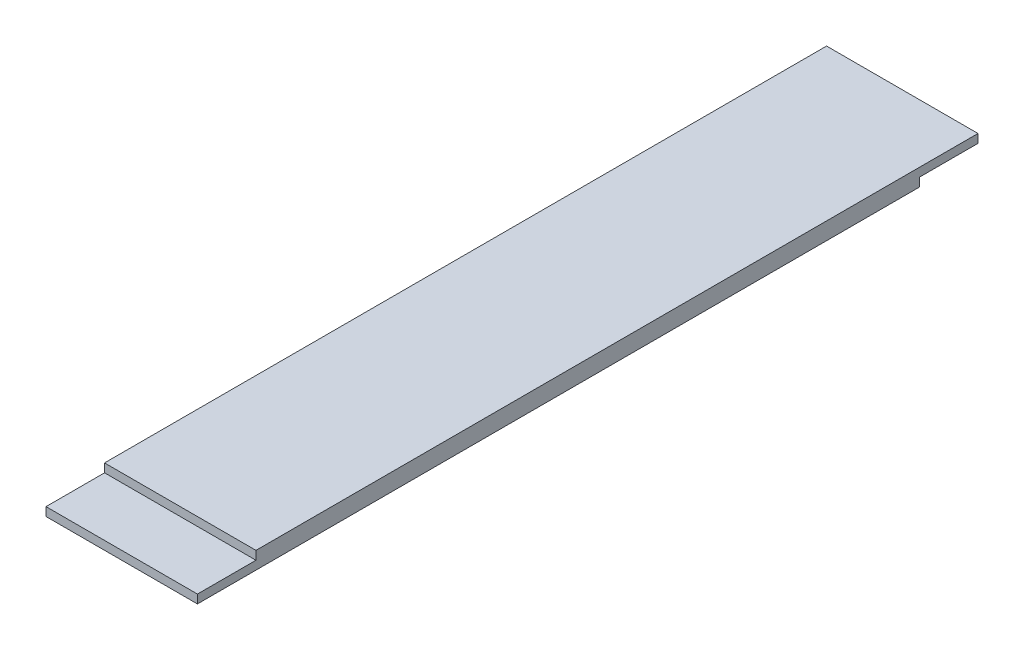
ISO-10303-21;
HEADER;
FILE_DESCRIPTION(('STEP AP214'),'2;1');
FILE_NAME('part.step','',(''),(''),'','','');
FILE_SCHEMA(('AUTOMOTIVE_DESIGN { 1 0 10303 214 1 1 1 1 }'));
ENDSEC;
DATA;
#1=APPLICATION_CONTEXT('core data for automotive mechanical design processes');
#2=APPLICATION_PROTOCOL_DEFINITION('international standard','automotive_design',2000,#1);
#3=PRODUCT_CONTEXT('',#1,'mechanical');
#4=PRODUCT('Part','Part','',(#3));
#5=PRODUCT_RELATED_PRODUCT_CATEGORY('part','',(#4));
#6=PRODUCT_DEFINITION_FORMATION('','',#4);
#7=PRODUCT_DEFINITION_CONTEXT('part definition',#1,'design');
#8=PRODUCT_DEFINITION('design','',#6,#7);
#9=PRODUCT_DEFINITION_SHAPE('','',#8);
#10=(LENGTH_UNIT() NAMED_UNIT(*) SI_UNIT(.MILLI.,.METRE.));
#11=(NAMED_UNIT(*) PLANE_ANGLE_UNIT() SI_UNIT($,.RADIAN.));
#12=(NAMED_UNIT(*) SI_UNIT($,.STERADIAN.) SOLID_ANGLE_UNIT());
#13=UNCERTAINTY_MEASURE_WITH_UNIT(LENGTH_MEASURE(1.E-05),#10,'distance_accuracy_value','');
#14=(GEOMETRIC_REPRESENTATION_CONTEXT(3) GLOBAL_UNCERTAINTY_ASSIGNED_CONTEXT((#13)) GLOBAL_UNIT_ASSIGNED_CONTEXT((#10,
#11,#12)) REPRESENTATION_CONTEXT('',''));
#15=CARTESIAN_POINT('',(0.,0.,0.));
#16=DIRECTION('',(0.,0.,1.));
#17=DIRECTION('',(1.,0.,0.));
#18=AXIS2_PLACEMENT_3D('',#15,#16,#17);
#19=CARTESIAN_POINT('',(19.4,4.4,100.));
#20=DIRECTION('',(-1.,0.,0.));
#21=DIRECTION('',(0.,0.,1.));
#22=AXIS2_PLACEMENT_3D('',#19,#20,#21);
#23=PLANE('',#22);
#24=DIRECTION('',(0.,0.,-1.));
#25=VECTOR('',#24,1.);
#26=CARTESIAN_POINT('',(19.4,0.,100.));
#27=LINE('',#26,#25);
#28=CARTESIAN_POINT('',(19.4,0.,100.));
#29=VERTEX_POINT('',#28);
#30=CARTESIAN_POINT('',(19.4,0.,-85.));
#31=VERTEX_POINT('',#30);
#32=EDGE_CURVE('E134',#29,#31,#27,.T.);
#33=ORIENTED_EDGE('',*,*,#32,.T.);
#34=DIRECTION('',(0.,-1.,0.));
#35=VECTOR('',#34,1.);
#36=CARTESIAN_POINT('',(19.4,2.2,-85.));
#37=LINE('',#36,#35);
#38=CARTESIAN_POINT('',(19.4,2.2,-85.));
#39=VERTEX_POINT('',#38);
#40=EDGE_CURVE('E47',#39,#31,#37,.T.);
#41=ORIENTED_EDGE('',*,*,#40,.F.);
#42=DIRECTION('',(0.,0.,1.));
#43=VECTOR('',#42,1.);
#44=CARTESIAN_POINT('',(19.4,2.2,-100.));
#45=LINE('',#44,#43);
#46=CARTESIAN_POINT('',(19.4,2.2,-100.));
#47=VERTEX_POINT('',#46);
#48=EDGE_CURVE('E116',#47,#39,#45,.T.);
#49=ORIENTED_EDGE('',*,*,#48,.F.);
#50=DIRECTION('',(0.,-1.,0.));
#51=VECTOR('',#50,1.);
#52=CARTESIAN_POINT('',(19.4,4.4,-100.));
#53=LINE('',#52,#51);
#54=CARTESIAN_POINT('',(19.4,4.4,-100.));
#55=VERTEX_POINT('',#54);
#56=EDGE_CURVE('E11',#55,#47,#53,.T.);
#57=ORIENTED_EDGE('',*,*,#56,.F.);
#58=DIRECTION('',(0.,0.,-1.));
#59=VECTOR('',#58,1.);
#60=CARTESIAN_POINT('',(19.4,4.4,100.));
#61=LINE('',#60,#59);
#62=CARTESIAN_POINT('',(19.4,4.4,85.));
#63=VERTEX_POINT('',#62);
#64=EDGE_CURVE('E131',#63,#55,#61,.T.);
#65=ORIENTED_EDGE('',*,*,#64,.F.);
#66=DIRECTION('',(0.,1.,0.));
#67=VECTOR('',#66,1.);
#68=CARTESIAN_POINT('',(19.4,2.2,85.));
#69=LINE('',#68,#67);
#70=CARTESIAN_POINT('',(19.4,2.2,85.));
#71=VERTEX_POINT('',#70);
#72=EDGE_CURVE('E55',#71,#63,#69,.T.);
#73=ORIENTED_EDGE('',*,*,#72,.F.);
#74=DIRECTION('',(0.,0.,-1.));
#75=VECTOR('',#74,1.);
#76=CARTESIAN_POINT('',(19.4,2.2,100.));
#77=LINE('',#76,#75);
#78=CARTESIAN_POINT('',(19.4,2.2,100.));
#79=VERTEX_POINT('',#78);
#80=EDGE_CURVE('E151',#79,#71,#77,.T.);
#81=ORIENTED_EDGE('',*,*,#80,.F.);
#82=DIRECTION('',(0.,-1.,0.));
#83=VECTOR('',#82,1.);
#84=CARTESIAN_POINT('',(19.4,4.4,100.));
#85=LINE('',#84,#83);
#86=EDGE_CURVE('E124',#79,#29,#85,.T.);
#87=ORIENTED_EDGE('',*,*,#86,.T.);
#88=EDGE_LOOP('',(#33,#41,#49,#57,#65,#73,#81,#87));
#89=FACE_BOUND('',#88,.T.);
#90=ADVANCED_FACE('F33',(#89),#23,.F.);
#91=CARTESIAN_POINT('',(-19.4,4.4,-100.));
#92=DIRECTION('',(0.,0.,1.));
#93=DIRECTION('',(1.,0.,0.));
#94=AXIS2_PLACEMENT_3D('',#91,#92,#93);
#95=PLANE('',#94);
#96=ORIENTED_EDGE('',*,*,#56,.T.);
#97=DIRECTION('',(1.,0.,0.));
#98=VECTOR('',#97,1.);
#99=CARTESIAN_POINT('',(-19.4,2.2,-100.));
#100=LINE('',#99,#98);
#101=CARTESIAN_POINT('',(-19.4,2.2,-100.));
#102=VERTEX_POINT('',#101);
#103=EDGE_CURVE('E102',#102,#47,#100,.T.);
#104=ORIENTED_EDGE('',*,*,#103,.F.);
#105=DIRECTION('',(0.,-1.,0.));
#106=VECTOR('',#105,1.);
#107=CARTESIAN_POINT('',(-19.4,4.4,-100.));
#108=LINE('',#107,#106);
#109=CARTESIAN_POINT('',(-19.4,4.4,-100.));
#110=VERTEX_POINT('',#109);
#111=EDGE_CURVE('E40',#110,#102,#108,.T.);
#112=ORIENTED_EDGE('',*,*,#111,.F.);
#113=DIRECTION('',(-1.,0.,0.));
#114=VECTOR('',#113,1.);
#115=CARTESIAN_POINT('',(-19.4,4.4,-100.));
#116=LINE('',#115,#114);
#117=EDGE_CURVE('E139',#55,#110,#116,.T.);
#118=ORIENTED_EDGE('',*,*,#117,.F.);
#119=EDGE_LOOP('',(#96,#104,#112,#118));
#120=FACE_BOUND('',#119,.T.);
#121=ADVANCED_FACE('F112',(#120),#95,.F.);
#122=CARTESIAN_POINT('',(-19.4,4.4,100.));
#123=DIRECTION('',(1.,0.,0.));
#124=DIRECTION('',(0.,0.,-1.));
#125=AXIS2_PLACEMENT_3D('',#122,#123,#124);
#126=PLANE('',#125);
#127=DIRECTION('',(0.,0.,-1.));
#128=VECTOR('',#127,1.);
#129=CARTESIAN_POINT('',(-19.4,2.2,-100.));
#130=LINE('',#129,#128);
#131=CARTESIAN_POINT('',(-19.4,2.2,-85.));
#132=VERTEX_POINT('',#131);
#133=EDGE_CURVE('E99',#132,#102,#130,.T.);
#134=ORIENTED_EDGE('',*,*,#133,.F.);
#135=DIRECTION('',(0.,-1.,0.));
#136=VECTOR('',#135,1.);
#137=CARTESIAN_POINT('',(-19.4,2.2,-85.));
#138=LINE('',#137,#136);
#139=CARTESIAN_POINT('',(-19.4,0.,-85.));
#140=VERTEX_POINT('',#139);
#141=EDGE_CURVE('E148',#132,#140,#138,.T.);
#142=ORIENTED_EDGE('',*,*,#141,.T.);
#143=DIRECTION('',(0.,0.,1.));
#144=VECTOR('',#143,1.);
#145=CARTESIAN_POINT('',(-19.4,0.,100.));
#146=LINE('',#145,#144);
#147=CARTESIAN_POINT('',(-19.4,0.,100.));
#148=VERTEX_POINT('',#147);
#149=EDGE_CURVE('E132',#140,#148,#146,.T.);
#150=ORIENTED_EDGE('',*,*,#149,.T.);
#151=DIRECTION('',(0.,-1.,0.));
#152=VECTOR('',#151,1.);
#153=CARTESIAN_POINT('',(-19.4,4.4,100.));
#154=LINE('',#153,#152);
#155=CARTESIAN_POINT('',(-19.4,2.2,100.));
#156=VERTEX_POINT('',#155);
#157=EDGE_CURVE('E122',#156,#148,#154,.T.);
#158=ORIENTED_EDGE('',*,*,#157,.F.);
#159=DIRECTION('',(0.,0.,1.));
#160=VECTOR('',#159,1.);
#161=CARTESIAN_POINT('',(-19.4,2.2,100.));
#162=LINE('',#161,#160);
#163=CARTESIAN_POINT('',(-19.4,2.2,85.));
#164=VERTEX_POINT('',#163);
#165=EDGE_CURVE('E147',#164,#156,#162,.T.);
#166=ORIENTED_EDGE('',*,*,#165,.F.);
#167=DIRECTION('',(0.,1.,0.));
#168=VECTOR('',#167,1.);
#169=CARTESIAN_POINT('',(-19.4,2.2,85.));
#170=LINE('',#169,#168);
#171=CARTESIAN_POINT('',(-19.4,4.4,85.));
#172=VERTEX_POINT('',#171);
#173=EDGE_CURVE('E137',#164,#172,#170,.T.);
#174=ORIENTED_EDGE('',*,*,#173,.T.);
#175=DIRECTION('',(0.,0.,1.));
#176=VECTOR('',#175,1.);
#177=CARTESIAN_POINT('',(-19.4,4.4,100.));
#178=LINE('',#177,#176);
#179=EDGE_CURVE('E121',#110,#172,#178,.T.);
#180=ORIENTED_EDGE('',*,*,#179,.F.);
#181=ORIENTED_EDGE('',*,*,#111,.T.);
#182=EDGE_LOOP('',(#134,#142,#150,#158,#166,#174,#180,#181));
#183=FACE_BOUND('',#182,.T.);
#184=ADVANCED_FACE('F118',(#183),#126,.F.);
#185=CARTESIAN_POINT('',(-19.4,4.4,100.));
#186=DIRECTION('',(0.,0.,-1.));
#187=DIRECTION('',(-1.,0.,0.));
#188=AXIS2_PLACEMENT_3D('',#185,#186,#187);
#189=PLANE('',#188);
#190=ORIENTED_EDGE('',*,*,#86,.F.);
#191=DIRECTION('',(1.,0.,0.));
#192=VECTOR('',#191,1.);
#193=CARTESIAN_POINT('',(-19.4,2.2,100.));
#194=LINE('',#193,#192);
#195=EDGE_CURVE('E153',#156,#79,#194,.T.);
#196=ORIENTED_EDGE('',*,*,#195,.F.);
#197=ORIENTED_EDGE('',*,*,#157,.T.);
#198=DIRECTION('',(1.,0.,0.));
#199=VECTOR('',#198,1.);
#200=CARTESIAN_POINT('',(-19.4,0.,100.));
#201=LINE('',#200,#199);
#202=EDGE_CURVE('E128',#148,#29,#201,.T.);
#203=ORIENTED_EDGE('',*,*,#202,.T.);
#204=EDGE_LOOP('',(#190,#196,#197,#203));
#205=FACE_BOUND('',#204,.T.);
#206=ADVANCED_FACE('F173',(#205),#189,.F.);
#207=CARTESIAN_POINT('',(0.,4.4,0.));
#208=DIRECTION('',(0.,-1.,0.));
#209=DIRECTION('',(0.,0.,-1.));
#210=AXIS2_PLACEMENT_3D('',#207,#208,#209);
#211=PLANE('',#210);
#212=ORIENTED_EDGE('',*,*,#179,.T.);
#213=DIRECTION('',(-1.,0.,0.));
#214=VECTOR('',#213,1.);
#215=CARTESIAN_POINT('',(-19.4,4.4,85.));
#216=LINE('',#215,#214);
#217=EDGE_CURVE('E145',#63,#172,#216,.T.);
#218=ORIENTED_EDGE('',*,*,#217,.F.);
#219=ORIENTED_EDGE('',*,*,#64,.T.);
#220=ORIENTED_EDGE('',*,*,#117,.T.);
#221=EDGE_LOOP('',(#212,#218,#219,#220));
#222=FACE_BOUND('',#221,.T.);
#223=ADVANCED_FACE('F178',(#222),#211,.F.);
#224=CARTESIAN_POINT('',(0.,0.,0.));
#225=DIRECTION('',(0.,-1.,0.));
#226=DIRECTION('',(0.,0.,-1.));
#227=AXIS2_PLACEMENT_3D('',#224,#225,#226);
#228=PLANE('',#227);
#229=DIRECTION('',(-1.,0.,0.));
#230=VECTOR('',#229,1.);
#231=CARTESIAN_POINT('',(-19.4,0.,-85.));
#232=LINE('',#231,#230);
#233=EDGE_CURVE('E108',#31,#140,#232,.T.);
#234=ORIENTED_EDGE('',*,*,#233,.F.);
#235=ORIENTED_EDGE('',*,*,#32,.F.);
#236=ORIENTED_EDGE('',*,*,#202,.F.);
#237=ORIENTED_EDGE('',*,*,#149,.F.);
#238=EDGE_LOOP('',(#234,#235,#236,#237));
#239=FACE_BOUND('',#238,.T.);
#240=ADVANCED_FACE('F167',(#239),#228,.T.);
#241=CARTESIAN_POINT('',(-19.4,2.2,85.));
#242=DIRECTION('',(0.,0.,-1.));
#243=DIRECTION('',(-1.,0.,0.));
#244=AXIS2_PLACEMENT_3D('',#241,#242,#243);
#245=PLANE('',#244);
#246=ORIENTED_EDGE('',*,*,#217,.T.);
#247=ORIENTED_EDGE('',*,*,#173,.F.);
#248=DIRECTION('',(-1.,0.,0.));
#249=VECTOR('',#248,1.);
#250=CARTESIAN_POINT('',(-19.4,2.2,85.));
#251=LINE('',#250,#249);
#252=EDGE_CURVE('E143',#71,#164,#251,.T.);
#253=ORIENTED_EDGE('',*,*,#252,.F.);
#254=ORIENTED_EDGE('',*,*,#72,.T.);
#255=EDGE_LOOP('',(#246,#247,#253,#254));
#256=FACE_BOUND('',#255,.T.);
#257=ADVANCED_FACE('F179',(#256),#245,.F.);
#258=CARTESIAN_POINT('',(0.,2.2,0.));
#259=DIRECTION('',(0.,-1.,0.));
#260=DIRECTION('',(0.,0.,-1.));
#261=AXIS2_PLACEMENT_3D('',#258,#259,#260);
#262=PLANE('',#261);
#263=ORIENTED_EDGE('',*,*,#165,.T.);
#264=ORIENTED_EDGE('',*,*,#195,.T.);
#265=ORIENTED_EDGE('',*,*,#80,.T.);
#266=ORIENTED_EDGE('',*,*,#252,.T.);
#267=EDGE_LOOP('',(#263,#264,#265,#266));
#268=FACE_BOUND('',#267,.T.);
#269=ADVANCED_FACE('F175',(#268),#262,.F.);
#270=CARTESIAN_POINT('',(-19.4,2.2,-85.));
#271=DIRECTION('',(0.,0.,1.));
#272=DIRECTION('',(1.,0.,0.));
#273=AXIS2_PLACEMENT_3D('',#270,#271,#272);
#274=PLANE('',#273);
#275=ORIENTED_EDGE('',*,*,#233,.T.);
#276=ORIENTED_EDGE('',*,*,#141,.F.);
#277=DIRECTION('',(-1.,0.,0.));
#278=VECTOR('',#277,1.);
#279=CARTESIAN_POINT('',(-19.4,2.2,-85.));
#280=LINE('',#279,#278);
#281=EDGE_CURVE('E104',#39,#132,#280,.T.);
#282=ORIENTED_EDGE('',*,*,#281,.F.);
#283=ORIENTED_EDGE('',*,*,#40,.T.);
#284=EDGE_LOOP('',(#275,#276,#282,#283));
#285=FACE_BOUND('',#284,.T.);
#286=ADVANCED_FACE('F161',(#285),#274,.F.);
#287=CARTESIAN_POINT('',(0.,2.2,0.));
#288=DIRECTION('',(0.,1.,0.));
#289=DIRECTION('',(0.,0.,1.));
#290=AXIS2_PLACEMENT_3D('',#287,#288,#289);
#291=PLANE('',#290);
#292=ORIENTED_EDGE('',*,*,#133,.T.);
#293=ORIENTED_EDGE('',*,*,#103,.T.);
#294=ORIENTED_EDGE('',*,*,#48,.T.);
#295=ORIENTED_EDGE('',*,*,#281,.T.);
#296=EDGE_LOOP('',(#292,#293,#294,#295));
#297=FACE_BOUND('',#296,.T.);
#298=ADVANCED_FACE('F101',(#297),#291,.F.);
#299=CLOSED_SHELL('',(#90,#121,#184,#206,#223,#240,#257,#269,#286,#298));
#300=MANIFOLD_SOLID_BREP('B2',#299);
#301=ADVANCED_BREP_SHAPE_REPRESENTATION('',(#18,#300),#14);
#302=SHAPE_DEFINITION_REPRESENTATION(#9,#301);
ENDSEC;
END-ISO-10303-21;
